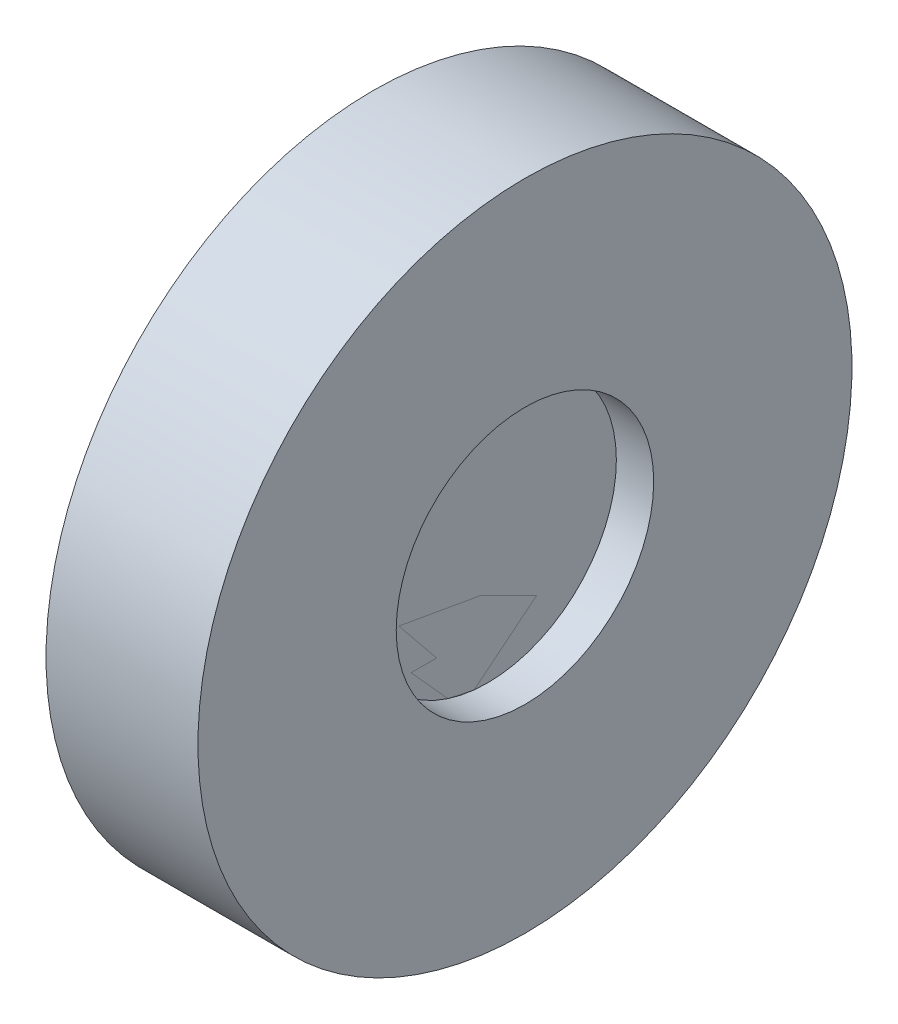
ISO-10303-21;
HEADER;
FILE_DESCRIPTION(('STEP AP214'),'2;1');
FILE_NAME('part.step','',(''),(''),'','','');
FILE_SCHEMA(('AUTOMOTIVE_DESIGN { 1 0 10303 214 1 1 1 1 }'));
ENDSEC;
DATA;
#1=APPLICATION_CONTEXT('core data for automotive mechanical design processes');
#2=APPLICATION_PROTOCOL_DEFINITION('international standard','automotive_design',2000,#1);
#3=PRODUCT_CONTEXT('',#1,'mechanical');
#4=PRODUCT('Part','Part','',(#3));
#5=PRODUCT_RELATED_PRODUCT_CATEGORY('part','',(#4));
#6=PRODUCT_DEFINITION_FORMATION('','',#4);
#7=PRODUCT_DEFINITION_CONTEXT('part definition',#1,'design');
#8=PRODUCT_DEFINITION('design','',#6,#7);
#9=PRODUCT_DEFINITION_SHAPE('','',#8);
#10=(LENGTH_UNIT() NAMED_UNIT(*) SI_UNIT(.MILLI.,.METRE.));
#11=(NAMED_UNIT(*) PLANE_ANGLE_UNIT() SI_UNIT($,.RADIAN.));
#12=(NAMED_UNIT(*) SI_UNIT($,.STERADIAN.) SOLID_ANGLE_UNIT());
#13=UNCERTAINTY_MEASURE_WITH_UNIT(LENGTH_MEASURE(1.E-05),#10,'distance_accuracy_value','');
#14=(GEOMETRIC_REPRESENTATION_CONTEXT(3) GLOBAL_UNCERTAINTY_ASSIGNED_CONTEXT((#13)) GLOBAL_UNIT_ASSIGNED_CONTEXT((#10,
#11,#12)) REPRESENTATION_CONTEXT('',''));
#15=CARTESIAN_POINT('',(0.,0.,0.));
#16=DIRECTION('',(0.,0.,1.));
#17=DIRECTION('',(1.,0.,0.));
#18=AXIS2_PLACEMENT_3D('',#15,#16,#17);
#19=CARTESIAN_POINT('',(-2.95,11.7,0.));
#20=DIRECTION('',(-1.,0.,0.));
#21=DIRECTION('',(0.,0.,1.));
#22=AXIS2_PLACEMENT_3D('',#19,#20,#21);
#23=PLANE('',#22);
#24=CARTESIAN_POINT('',(-2.95,0.,0.));
#25=DIRECTION('',(1.,0.,0.));
#26=DIRECTION('',(0.,0.,-1.));
#27=AXIS2_PLACEMENT_3D('',#24,#25,#26);
#28=CIRCLE('',#27,5.);
#29=CARTESIAN_POINT('',(-2.95,5.,0.));
#30=VERTEX_POINT('',#29);
#31=CARTESIAN_POINT('',(-2.95,-5.,0.));
#32=VERTEX_POINT('',#31);
#33=EDGE_CURVE('P0_E26',#30,#32,#28,.T.);
#34=ORIENTED_EDGE('',*,*,#33,.T.);
#35=CARTESIAN_POINT('',(-2.95,0.,0.));
#36=DIRECTION('',(1.,0.,0.));
#37=DIRECTION('',(0.,0.,-1.));
#38=AXIS2_PLACEMENT_3D('',#35,#36,#37);
#39=CIRCLE('',#38,5.);
#40=EDGE_CURVE('P0_E10',#32,#30,#39,.T.);
#41=ORIENTED_EDGE('',*,*,#40,.T.);
#42=EDGE_LOOP('',(#34,#41));
#43=FACE_BOUND('',#42,.T.);
#44=CARTESIAN_POINT('',(-2.95,0.,0.));
#45=DIRECTION('',(1.,0.,0.));
#46=DIRECTION('',(0.,0.,-1.));
#47=AXIS2_PLACEMENT_3D('',#44,#45,#46);
#48=CIRCLE('',#47,11.7);
#49=CARTESIAN_POINT('',(-2.95,11.7,0.));
#50=VERTEX_POINT('',#49);
#51=CARTESIAN_POINT('',(-2.95,-11.7,0.));
#52=VERTEX_POINT('',#51);
#53=EDGE_CURVE('P0_E54',#50,#52,#48,.T.);
#54=ORIENTED_EDGE('',*,*,#53,.F.);
#55=CARTESIAN_POINT('',(-2.95,0.,0.));
#56=DIRECTION('',(1.,0.,0.));
#57=DIRECTION('',(0.,0.,-1.));
#58=AXIS2_PLACEMENT_3D('',#55,#56,#57);
#59=CIRCLE('',#58,11.7);
#60=EDGE_CURVE('P0_E89',#52,#50,#59,.T.);
#61=ORIENTED_EDGE('',*,*,#60,.F.);
#62=EDGE_LOOP('',(#54,#61));
#63=FACE_BOUND('',#62,.T.);
#64=ADVANCED_FACE('P0_F15',(#43,#63),#23,.T.);
#65=CARTESIAN_POINT('',(-2.2,0.,0.));
#66=DIRECTION('',(1.,0.,0.));
#67=DIRECTION('',(0.,1.,0.));
#68=AXIS2_PLACEMENT_3D('',#65,#66,#67);
#69=CYLINDRICAL_SURFACE('',#68,5.);
#70=CARTESIAN_POINT('',(-1.45,0.,0.));
#71=DIRECTION('',(1.,0.,0.));
#72=DIRECTION('',(0.,0.,-1.));
#73=AXIS2_PLACEMENT_3D('',#70,#71,#72);
#74=CIRCLE('',#73,5.);
#75=CARTESIAN_POINT('',(-1.45,5.,0.));
#76=VERTEX_POINT('',#75);
#77=CARTESIAN_POINT('',(-1.45,-5.,0.));
#78=VERTEX_POINT('',#77);
#79=EDGE_CURVE('P0_E78',#76,#78,#74,.T.);
#80=ORIENTED_EDGE('',*,*,#79,.T.);
#81=DIRECTION('',(-1.,0.,0.));
#82=VECTOR('',#81,1.);
#83=CARTESIAN_POINT('',(-2.2,-5.,0.));
#84=LINE('',#83,#82);
#85=EDGE_CURVE('P0_E19',#78,#32,#84,.T.);
#86=ORIENTED_EDGE('',*,*,#85,.T.);
#87=ORIENTED_EDGE('',*,*,#33,.F.);
#88=ORIENTED_EDGE('',*,*,#40,.F.);
#89=ORIENTED_EDGE('',*,*,#85,.F.);
#90=CARTESIAN_POINT('',(-1.45,0.,0.));
#91=DIRECTION('',(1.,0.,0.));
#92=DIRECTION('',(0.,0.,-1.));
#93=AXIS2_PLACEMENT_3D('',#90,#91,#92);
#94=CIRCLE('',#93,5.);
#95=EDGE_CURVE('P0_E74',#78,#76,#94,.T.);
#96=ORIENTED_EDGE('',*,*,#95,.T.);
#97=EDGE_LOOP('',(#80,#86,#87,#88,#89,#96));
#98=FACE_BOUND('',#97,.T.);
#99=ADVANCED_FACE('P0_F76',(#98),#69,.F.);
#100=CARTESIAN_POINT('',(-1.45,5.,0.));
#101=DIRECTION('',(1.,0.,0.));
#102=DIRECTION('',(0.,1.,0.));
#103=AXIS2_PLACEMENT_3D('',#100,#101,#102);
#104=PLANE('',#103);
#105=ORIENTED_EDGE('',*,*,#79,.F.);
#106=ORIENTED_EDGE('',*,*,#95,.F.);
#107=EDGE_LOOP('',(#105,#106));
#108=FACE_BOUND('',#107,.T.);
#109=CARTESIAN_POINT('',(-1.45,0.,0.));
#110=DIRECTION('',(1.,0.,0.));
#111=DIRECTION('',(0.,0.,-1.));
#112=AXIS2_PLACEMENT_3D('',#109,#110,#111);
#113=CIRCLE('',#112,11.7);
#114=CARTESIAN_POINT('',(-1.45,11.7,0.));
#115=VERTEX_POINT('',#114);
#116=CARTESIAN_POINT('',(-1.45,-11.7,0.));
#117=VERTEX_POINT('',#116);
#118=EDGE_CURVE('P0_E100',#115,#117,#113,.T.);
#119=ORIENTED_EDGE('',*,*,#118,.T.);
#120=CARTESIAN_POINT('',(-1.45,0.,0.));
#121=DIRECTION('',(1.,0.,0.));
#122=DIRECTION('',(0.,0.,-1.));
#123=AXIS2_PLACEMENT_3D('',#120,#121,#122);
#124=CIRCLE('',#123,11.7);
#125=EDGE_CURVE('P0_E95',#117,#115,#124,.T.);
#126=ORIENTED_EDGE('',*,*,#125,.T.);
#127=EDGE_LOOP('',(#119,#126));
#128=FACE_BOUND('',#127,.T.);
#129=ADVANCED_FACE('P0_F17',(#108,#128),#104,.T.);
#130=CARTESIAN_POINT('',(-2.2,0.,0.));
#131=DIRECTION('',(1.,0.,0.));
#132=DIRECTION('',(0.,1.,0.));
#133=AXIS2_PLACEMENT_3D('',#130,#131,#132);
#134=CYLINDRICAL_SURFACE('',#133,11.7);
#135=ORIENTED_EDGE('',*,*,#118,.F.);
#136=ORIENTED_EDGE('',*,*,#125,.F.);
#137=DIRECTION('',(-1.,0.,0.));
#138=VECTOR('',#137,1.);
#139=CARTESIAN_POINT('',(-2.2,-11.7,0.));
#140=LINE('',#139,#138);
#141=EDGE_CURVE('P0_E62',#117,#52,#140,.T.);
#142=ORIENTED_EDGE('',*,*,#141,.T.);
#143=ORIENTED_EDGE('',*,*,#60,.T.);
#144=ORIENTED_EDGE('',*,*,#53,.T.);
#145=ORIENTED_EDGE('',*,*,#141,.F.);
#146=EDGE_LOOP('',(#135,#136,#142,#143,#144,#145));
#147=FACE_BOUND('',#146,.T.);
#148=ADVANCED_FACE('P0_F129',(#147),#134,.T.);
#149=CLOSED_SHELL('',(#64,#99,#129,#148));
#150=MANIFOLD_SOLID_BREP('P0_B1',#149);
#151=CARTESIAN_POINT('',(0.,0.,0.));
#152=DIRECTION('',(1.,0.,0.));
#153=DIRECTION('',(0.,1.,0.));
#154=AXIS2_PLACEMENT_3D('',#151,#152,#153);
#155=CYLINDRICAL_SURFACE('',#154,12.7);
#156=CARTESIAN_POINT('',(2.95,0.,0.));
#157=DIRECTION('',(1.,0.,0.));
#158=DIRECTION('',(0.,0.,-1.));
#159=AXIS2_PLACEMENT_3D('',#156,#157,#158);
#160=CIRCLE('',#159,12.7);
#161=CARTESIAN_POINT('',(2.95,12.7,0.));
#162=VERTEX_POINT('',#161);
#163=CARTESIAN_POINT('',(2.95,-12.7,0.));
#164=VERTEX_POINT('',#163);
#165=EDGE_CURVE('P1_E80',#162,#164,#160,.T.);
#166=ORIENTED_EDGE('',*,*,#165,.F.);
#167=CARTESIAN_POINT('',(2.95,0.,0.));
#168=DIRECTION('',(1.,0.,0.));
#169=DIRECTION('',(0.,0.,-1.));
#170=AXIS2_PLACEMENT_3D('',#167,#168,#169);
#171=CIRCLE('',#170,12.7);
#172=EDGE_CURVE('P1_E83',#164,#162,#171,.T.);
#173=ORIENTED_EDGE('',*,*,#172,.F.);
#174=DIRECTION('',(-1.,0.,0.));
#175=VECTOR('',#174,1.);
#176=CARTESIAN_POINT('',(0.,-12.7,0.));
#177=LINE('',#176,#175);
#178=CARTESIAN_POINT('',(-2.95,-12.7,0.));
#179=VERTEX_POINT('',#178);
#180=EDGE_CURVE('P1_E11',#164,#179,#177,.T.);
#181=ORIENTED_EDGE('',*,*,#180,.T.);
#182=CARTESIAN_POINT('',(-2.95,0.,0.));
#183=DIRECTION('',(1.,0.,0.));
#184=DIRECTION('',(0.,0.,-1.));
#185=AXIS2_PLACEMENT_3D('',#182,#183,#184);
#186=CIRCLE('',#185,12.7);
#187=CARTESIAN_POINT('',(-2.95,12.7,0.));
#188=VERTEX_POINT('',#187);
#189=EDGE_CURVE('P1_E27',#179,#188,#186,.T.);
#190=ORIENTED_EDGE('',*,*,#189,.T.);
#191=CARTESIAN_POINT('',(-2.95,0.,0.));
#192=DIRECTION('',(1.,0.,0.));
#193=DIRECTION('',(0.,0.,-1.));
#194=AXIS2_PLACEMENT_3D('',#191,#192,#193);
#195=CIRCLE('',#194,12.7);
#196=EDGE_CURVE('P1_E82',#188,#179,#195,.T.);
#197=ORIENTED_EDGE('',*,*,#196,.T.);
#198=ORIENTED_EDGE('',*,*,#180,.F.);
#199=EDGE_LOOP('',(#166,#173,#181,#190,#197,#198));
#200=FACE_BOUND('',#199,.T.);
#201=ADVANCED_FACE('P1_F16',(#200),#155,.T.);
#202=CARTESIAN_POINT('',(-2.95,12.7,0.));
#203=DIRECTION('',(-1.,0.,0.));
#204=DIRECTION('',(0.,0.,1.));
#205=AXIS2_PLACEMENT_3D('',#202,#203,#204);
#206=PLANE('',#205);
#207=CARTESIAN_POINT('',(-2.95,0.,0.));
#208=DIRECTION('',(1.,0.,0.));
#209=DIRECTION('',(0.,0.,-1.));
#210=AXIS2_PLACEMENT_3D('',#207,#208,#209);
#211=CIRCLE('',#210,11.7);
#212=CARTESIAN_POINT('',(-2.95,11.7,0.));
#213=VERTEX_POINT('',#212);
#214=CARTESIAN_POINT('',(-2.95,-11.7,0.));
#215=VERTEX_POINT('',#214);
#216=EDGE_CURVE('P1_E20',#213,#215,#211,.T.);
#217=ORIENTED_EDGE('',*,*,#216,.T.);
#218=CARTESIAN_POINT('',(-2.95,0.,0.));
#219=DIRECTION('',(1.,0.,0.));
#220=DIRECTION('',(0.,0.,-1.));
#221=AXIS2_PLACEMENT_3D('',#218,#219,#220);
#222=CIRCLE('',#221,11.7);
#223=EDGE_CURVE('P1_E121',#215,#213,#222,.T.);
#224=ORIENTED_EDGE('',*,*,#223,.T.);
#225=EDGE_LOOP('',(#217,#224));
#226=FACE_BOUND('',#225,.T.);
#227=ORIENTED_EDGE('',*,*,#196,.F.);
#228=ORIENTED_EDGE('',*,*,#189,.F.);
#229=EDGE_LOOP('',(#227,#228));
#230=FACE_BOUND('',#229,.T.);
#231=ADVANCED_FACE('P1_F134',(#226,#230),#206,.T.);
#232=CARTESIAN_POINT('',(-2.2,0.,0.));
#233=DIRECTION('',(1.,0.,0.));
#234=DIRECTION('',(0.,1.,0.));
#235=AXIS2_PLACEMENT_3D('',#232,#233,#234);
#236=CYLINDRICAL_SURFACE('',#235,11.7);
#237=CARTESIAN_POINT('',(-1.45,0.,0.));
#238=DIRECTION('',(1.,0.,0.));
#239=DIRECTION('',(0.,0.,-1.));
#240=AXIS2_PLACEMENT_3D('',#237,#238,#239);
#241=CIRCLE('',#240,11.7);
#242=CARTESIAN_POINT('',(-1.45,11.7,0.));
#243=VERTEX_POINT('',#242);
#244=CARTESIAN_POINT('',(-1.45,-11.7,0.));
#245=VERTEX_POINT('',#244);
#246=EDGE_CURVE('P1_E99',#243,#245,#241,.T.);
#247=ORIENTED_EDGE('',*,*,#246,.T.);
#248=DIRECTION('',(-1.,0.,0.));
#249=VECTOR('',#248,1.);
#250=CARTESIAN_POINT('',(-2.2,-11.7,0.));
#251=LINE('',#250,#249);
#252=EDGE_CURVE('P1_E111',#245,#215,#251,.T.);
#253=ORIENTED_EDGE('',*,*,#252,.T.);
#254=ORIENTED_EDGE('',*,*,#216,.F.);
#255=ORIENTED_EDGE('',*,*,#223,.F.);
#256=ORIENTED_EDGE('',*,*,#252,.F.);
#257=CARTESIAN_POINT('',(-1.45,0.,0.));
#258=DIRECTION('',(1.,0.,0.));
#259=DIRECTION('',(0.,0.,-1.));
#260=AXIS2_PLACEMENT_3D('',#257,#258,#259);
#261=CIRCLE('',#260,11.7);
#262=EDGE_CURVE('P1_E104',#245,#243,#261,.T.);
#263=ORIENTED_EDGE('',*,*,#262,.T.);
#264=EDGE_LOOP('',(#247,#253,#254,#255,#256,#263));
#265=FACE_BOUND('',#264,.T.);
#266=ADVANCED_FACE('P1_F136',(#265),#236,.F.);
#267=CARTESIAN_POINT('',(-1.45,11.7,0.));
#268=DIRECTION('',(-1.,0.,0.));
#269=DIRECTION('',(0.,0.,1.));
#270=AXIS2_PLACEMENT_3D('',#267,#268,#269);
#271=PLANE('',#270);
#272=ORIENTED_EDGE('',*,*,#246,.F.);
#273=ORIENTED_EDGE('',*,*,#262,.F.);
#274=EDGE_LOOP('',(#272,#273));
#275=FACE_BOUND('',#274,.T.);
#276=ADVANCED_FACE('P1_F138',(#275),#271,.T.);
#277=CARTESIAN_POINT('',(1.5,0.,0.));
#278=DIRECTION('',(1.,0.,0.));
#279=DIRECTION('',(0.,1.,0.));
#280=AXIS2_PLACEMENT_3D('',#277,#278,#279);
#281=PLANE('',#280);
#282=CARTESIAN_POINT('',(1.5,0.,0.));
#283=DIRECTION('',(1.,0.,0.));
#284=DIRECTION('',(0.,0.,-1.));
#285=AXIS2_PLACEMENT_3D('',#282,#283,#284);
#286=CIRCLE('',#285,5.);
#287=CARTESIAN_POINT('',(1.5,5.,0.));
#288=VERTEX_POINT('',#287);
#289=CARTESIAN_POINT('',(1.5,-5.,0.));
#290=VERTEX_POINT('',#289);
#291=EDGE_CURVE('P1_E100',#288,#290,#286,.T.);
#292=ORIENTED_EDGE('',*,*,#291,.T.);
#293=CARTESIAN_POINT('',(1.5,0.,0.));
#294=DIRECTION('',(1.,0.,0.));
#295=DIRECTION('',(0.,0.,-1.));
#296=AXIS2_PLACEMENT_3D('',#293,#294,#295);
#297=CIRCLE('',#296,5.);
#298=EDGE_CURVE('P1_E97',#290,#288,#297,.T.);
#299=ORIENTED_EDGE('',*,*,#298,.T.);
#300=EDGE_LOOP('',(#292,#299));
#301=FACE_BOUND('',#300,.T.);
#302=ADVANCED_FACE('P1_F140',(#301),#281,.T.);
#303=CARTESIAN_POINT('',(2.225,0.,0.));
#304=DIRECTION('',(1.,0.,0.));
#305=DIRECTION('',(0.,1.,0.));
#306=AXIS2_PLACEMENT_3D('',#303,#304,#305);
#307=CYLINDRICAL_SURFACE('',#306,5.);
#308=CARTESIAN_POINT('',(2.95,0.,0.));
#309=DIRECTION('',(1.,0.,0.));
#310=DIRECTION('',(0.,0.,-1.));
#311=AXIS2_PLACEMENT_3D('',#308,#309,#310);
#312=CIRCLE('',#311,5.);
#313=CARTESIAN_POINT('',(2.95,5.,0.));
#314=VERTEX_POINT('',#313);
#315=CARTESIAN_POINT('',(2.95,-5.,0.));
#316=VERTEX_POINT('',#315);
#317=EDGE_CURVE('P1_E86',#314,#316,#312,.T.);
#318=ORIENTED_EDGE('',*,*,#317,.T.);
#319=DIRECTION('',(-1.,0.,0.));
#320=VECTOR('',#319,1.);
#321=CARTESIAN_POINT('',(2.225,-5.,0.));
#322=LINE('',#321,#320);
#323=EDGE_CURVE('P1_E171',#316,#290,#322,.T.);
#324=ORIENTED_EDGE('',*,*,#323,.T.);
#325=ORIENTED_EDGE('',*,*,#291,.F.);
#326=ORIENTED_EDGE('',*,*,#298,.F.);
#327=ORIENTED_EDGE('',*,*,#323,.F.);
#328=CARTESIAN_POINT('',(2.95,0.,0.));
#329=DIRECTION('',(1.,0.,0.));
#330=DIRECTION('',(0.,0.,-1.));
#331=AXIS2_PLACEMENT_3D('',#328,#329,#330);
#332=CIRCLE('',#331,5.);
#333=EDGE_CURVE('P1_E165',#316,#314,#332,.T.);
#334=ORIENTED_EDGE('',*,*,#333,.T.);
#335=EDGE_LOOP('',(#318,#324,#325,#326,#327,#334));
#336=FACE_BOUND('',#335,.T.);
#337=ADVANCED_FACE('P1_F18',(#336),#307,.F.);
#338=CARTESIAN_POINT('',(2.95,5.,0.));
#339=DIRECTION('',(1.,0.,0.));
#340=DIRECTION('',(0.,1.,0.));
#341=AXIS2_PLACEMENT_3D('',#338,#339,#340);
#342=PLANE('',#341);
#343=ORIENTED_EDGE('',*,*,#317,.F.);
#344=ORIENTED_EDGE('',*,*,#333,.F.);
#345=EDGE_LOOP('',(#343,#344));
#346=FACE_BOUND('',#345,.T.);
#347=ORIENTED_EDGE('',*,*,#165,.T.);
#348=ORIENTED_EDGE('',*,*,#172,.T.);
#349=EDGE_LOOP('',(#347,#348));
#350=FACE_BOUND('',#349,.T.);
#351=ADVANCED_FACE('P1_F88',(#346,#350),#342,.T.);
#352=CLOSED_SHELL('',(#201,#231,#266,#276,#302,#337,#351));
#353=MANIFOLD_SOLID_BREP('P1_B1',#352);
#354=CARTESIAN_POINT('',(0.,0.,0.));
#355=DIRECTION('',(1.,0.,0.));
#356=DIRECTION('',(0.,1.,0.));
#357=AXIS2_PLACEMENT_3D('',#354,#355,#356);
#358=PLANE('',#357);
#359=CARTESIAN_POINT('',(0.,0.,0.));
#360=DIRECTION('',(1.,0.,0.));
#361=DIRECTION('',(0.,0.,-1.));
#362=AXIS2_PLACEMENT_3D('',#359,#360,#361);
#363=CIRCLE('',#362,7.5);
#364=CARTESIAN_POINT('',(0.,7.5,0.));
#365=VERTEX_POINT('',#364);
#366=CARTESIAN_POINT('',(0.,-7.5,0.));
#367=VERTEX_POINT('',#366);
#368=EDGE_CURVE('P2_E57',#365,#367,#363,.T.);
#369=ORIENTED_EDGE('',*,*,#368,.T.);
#370=CARTESIAN_POINT('',(0.,0.,0.));
#371=DIRECTION('',(1.,0.,0.));
#372=DIRECTION('',(0.,0.,-1.));
#373=AXIS2_PLACEMENT_3D('',#370,#371,#372);
#374=CIRCLE('',#373,7.5);
#375=EDGE_CURVE('P2_E27',#367,#365,#374,.T.);
#376=ORIENTED_EDGE('',*,*,#375,.T.);
#377=EDGE_LOOP('',(#369,#376));
#378=FACE_BOUND('',#377,.T.);
#379=ADVANCED_FACE('P2_F16',(#378),#358,.T.);
#380=CARTESIAN_POINT('',(-0.724999999999978,0.,0.));
#381=DIRECTION('',(1.,0.,0.));
#382=DIRECTION('',(0.,1.,0.));
#383=AXIS2_PLACEMENT_3D('',#380,#381,#382);
#384=CYLINDRICAL_SURFACE('',#383,7.5);
#385=ORIENTED_EDGE('',*,*,#368,.F.);
#386=ORIENTED_EDGE('',*,*,#375,.F.);
#387=DIRECTION('',(-1.,0.,0.));
#388=VECTOR('',#387,1.);
#389=CARTESIAN_POINT('',(-0.724999999999955,-7.5,0.));
#390=LINE('',#389,#388);
#391=CARTESIAN_POINT('',(-1.44999999999996,-7.5,0.));
#392=VERTEX_POINT('',#391);
#393=EDGE_CURVE('P2_E11',#367,#392,#390,.T.);
#394=ORIENTED_EDGE('',*,*,#393,.T.);
#395=CARTESIAN_POINT('',(-1.44999999999998,0.,0.));
#396=DIRECTION('',(1.,0.,0.));
#397=DIRECTION('',(0.,0.,-1.));
#398=AXIS2_PLACEMENT_3D('',#395,#396,#397);
#399=CIRCLE('',#398,7.5);
#400=CARTESIAN_POINT('',(-1.45,7.5,0.));
#401=VERTEX_POINT('',#400);
#402=EDGE_CURVE('P2_E20',#392,#401,#399,.T.);
#403=ORIENTED_EDGE('',*,*,#402,.T.);
#404=CARTESIAN_POINT('',(-1.44999999999998,0.,0.));
#405=DIRECTION('',(1.,0.,0.));
#406=DIRECTION('',(0.,0.,-1.));
#407=AXIS2_PLACEMENT_3D('',#404,#405,#406);
#408=CIRCLE('',#407,7.5);
#409=EDGE_CURVE('P2_E55',#401,#392,#408,.T.);
#410=ORIENTED_EDGE('',*,*,#409,.T.);
#411=ORIENTED_EDGE('',*,*,#393,.F.);
#412=EDGE_LOOP('',(#385,#386,#394,#403,#410,#411));
#413=FACE_BOUND('',#412,.T.);
#414=ADVANCED_FACE('P2_F18',(#413),#384,.T.);
#415=CARTESIAN_POINT('',(-1.45,7.5,0.));
#416=DIRECTION('',(-1.,0.,0.));
#417=DIRECTION('',(0.,1.,0.));
#418=AXIS2_PLACEMENT_3D('',#415,#416,#417);
#419=PLANE('',#418);
#420=ORIENTED_EDGE('',*,*,#409,.F.);
#421=ORIENTED_EDGE('',*,*,#402,.F.);
#422=EDGE_LOOP('',(#420,#421));
#423=FACE_BOUND('',#422,.T.);
#424=ADVANCED_FACE('P2_F54',(#423),#419,.T.);
#425=CLOSED_SHELL('',(#379,#414,#424));
#426=MANIFOLD_SOLID_BREP('P2_B1',#425);
#427=CARTESIAN_POINT('',(1.5,0.,0.));
#428=DIRECTION('',(1.,0.,0.));
#429=DIRECTION('',(0.,1.,0.));
#430=AXIS2_PLACEMENT_3D('',#427,#428,#429);
#431=PLANE('',#430);
#432=CARTESIAN_POINT('',(1.5,0.,0.));
#433=DIRECTION('',(1.,0.,0.));
#434=DIRECTION('',(0.,0.,-1.));
#435=AXIS2_PLACEMENT_3D('',#432,#433,#434);
#436=CIRCLE('',#435,7.5);
#437=CARTESIAN_POINT('',(1.5,7.5,0.));
#438=VERTEX_POINT('',#437);
#439=CARTESIAN_POINT('',(1.5,-7.5,0.));
#440=VERTEX_POINT('',#439);
#441=EDGE_CURVE('P3_E56',#438,#440,#436,.T.);
#442=ORIENTED_EDGE('',*,*,#441,.T.);
#443=CARTESIAN_POINT('',(1.5,0.,0.));
#444=DIRECTION('',(1.,0.,0.));
#445=DIRECTION('',(0.,0.,-1.));
#446=AXIS2_PLACEMENT_3D('',#443,#444,#445);
#447=CIRCLE('',#446,7.5);
#448=EDGE_CURVE('P3_E18',#440,#438,#447,.T.);
#449=ORIENTED_EDGE('',*,*,#448,.T.);
#450=EDGE_LOOP('',(#442,#449));
#451=FACE_BOUND('',#450,.T.);
#452=ADVANCED_FACE('P3_F15',(#451),#431,.T.);
#453=CARTESIAN_POINT('',(0.750000000000011,0.,0.));
#454=DIRECTION('',(1.,0.,0.));
#455=DIRECTION('',(0.,1.,0.));
#456=AXIS2_PLACEMENT_3D('',#453,#454,#455);
#457=CYLINDRICAL_SURFACE('',#456,7.5);
#458=ORIENTED_EDGE('',*,*,#441,.F.);
#459=ORIENTED_EDGE('',*,*,#448,.F.);
#460=DIRECTION('',(-1.,0.,0.));
#461=VECTOR('',#460,1.);
#462=CARTESIAN_POINT('',(0.750000000000022,-7.5,0.));
#463=LINE('',#462,#461);
#464=CARTESIAN_POINT('',(0.,-7.5,0.));
#465=VERTEX_POINT('',#464);
#466=EDGE_CURVE('P3_E10',#440,#465,#463,.T.);
#467=ORIENTED_EDGE('',*,*,#466,.T.);
#468=CARTESIAN_POINT('',(0.,0.,0.));
#469=DIRECTION('',(1.,0.,0.));
#470=DIRECTION('',(0.,1.,0.));
#471=AXIS2_PLACEMENT_3D('',#468,#469,#470);
#472=CIRCLE('',#471,7.5);
#473=CARTESIAN_POINT('',(0.,7.5,0.));
#474=VERTEX_POINT('',#473);
#475=EDGE_CURVE('P3_E45',#465,#474,#472,.T.);
#476=ORIENTED_EDGE('',*,*,#475,.T.);
#477=CARTESIAN_POINT('',(0.,0.,0.));
#478=DIRECTION('',(1.,0.,0.));
#479=DIRECTION('',(0.,1.,0.));
#480=AXIS2_PLACEMENT_3D('',#477,#478,#479);
#481=CIRCLE('',#480,7.5);
#482=EDGE_CURVE('P3_E54',#474,#465,#481,.T.);
#483=ORIENTED_EDGE('',*,*,#482,.T.);
#484=ORIENTED_EDGE('',*,*,#466,.F.);
#485=EDGE_LOOP('',(#458,#459,#467,#476,#483,#484));
#486=FACE_BOUND('',#485,.T.);
#487=ADVANCED_FACE('P3_F50',(#486),#457,.T.);
#488=CARTESIAN_POINT('',(0.,0.,0.));
#489=DIRECTION('',(1.,0.,0.));
#490=DIRECTION('',(0.,1.,0.));
#491=AXIS2_PLACEMENT_3D('',#488,#489,#490);
#492=PLANE('',#491);
#493=ORIENTED_EDGE('',*,*,#482,.F.);
#494=ORIENTED_EDGE('',*,*,#475,.F.);
#495=EDGE_LOOP('',(#493,#494));
#496=FACE_BOUND('',#495,.T.);
#497=ADVANCED_FACE('P3_F53',(#496),#492,.F.);
#498=CLOSED_SHELL('',(#452,#487,#497));
#499=MANIFOLD_SOLID_BREP('P3_B1',#498);
#500=ADVANCED_BREP_SHAPE_REPRESENTATION('',(#18,#150,#353,#426,#499),#14);
#501=SHAPE_DEFINITION_REPRESENTATION(#9,#500);
ENDSEC;
END-ISO-10303-21;
